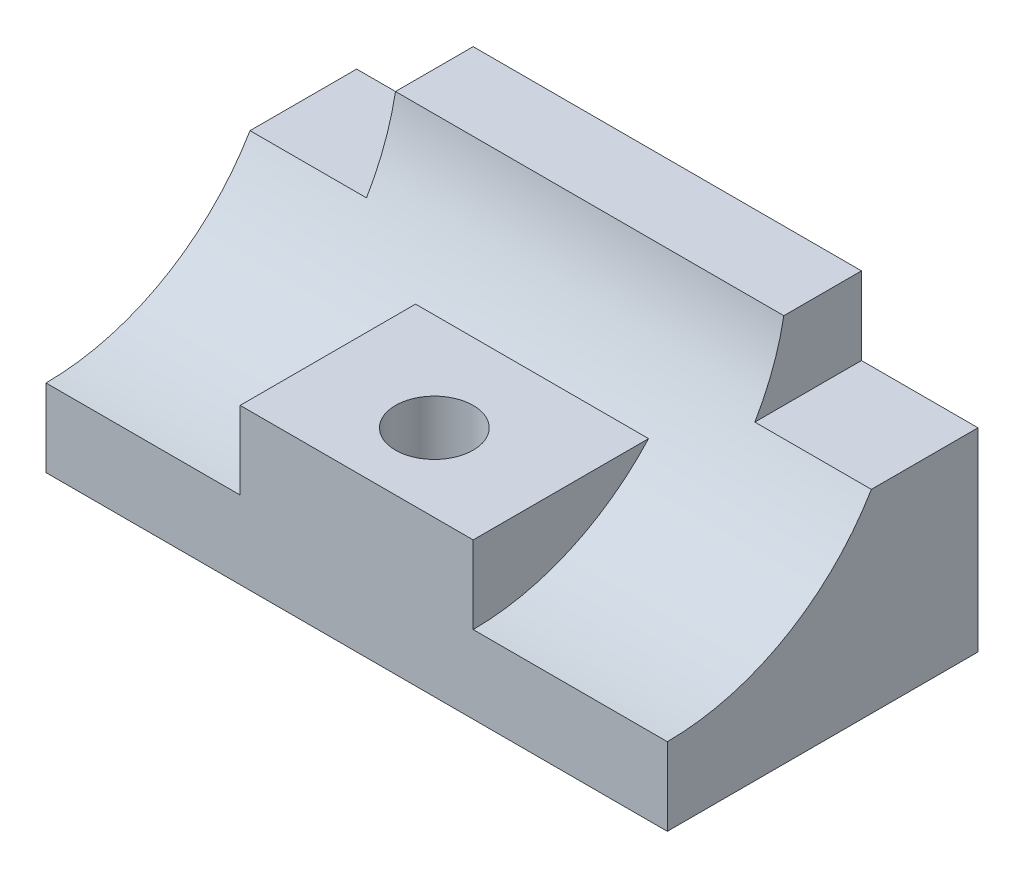
ISO-10303-21;
HEADER;
FILE_DESCRIPTION(('STEP AP214'),'2;1');
FILE_NAME('part.step','',(''),(''),'','','');
FILE_SCHEMA(('AUTOMOTIVE_DESIGN { 1 0 10303 214 1 1 1 1 }'));
ENDSEC;
DATA;
#1=APPLICATION_CONTEXT('core data for automotive mechanical design processes');
#2=APPLICATION_PROTOCOL_DEFINITION('international standard','automotive_design',2000,#1);
#3=PRODUCT_CONTEXT('',#1,'mechanical');
#4=PRODUCT('Part','Part','',(#3));
#5=PRODUCT_RELATED_PRODUCT_CATEGORY('part','',(#4));
#6=PRODUCT_DEFINITION_FORMATION('','',#4);
#7=PRODUCT_DEFINITION_CONTEXT('part definition',#1,'design');
#8=PRODUCT_DEFINITION('design','',#6,#7);
#9=PRODUCT_DEFINITION_SHAPE('','',#8);
#10=(LENGTH_UNIT() NAMED_UNIT(*) SI_UNIT(.MILLI.,.METRE.));
#11=(NAMED_UNIT(*) PLANE_ANGLE_UNIT() SI_UNIT($,.RADIAN.));
#12=(NAMED_UNIT(*) SI_UNIT($,.STERADIAN.) SOLID_ANGLE_UNIT());
#13=UNCERTAINTY_MEASURE_WITH_UNIT(LENGTH_MEASURE(1.E-05),#10,'distance_accuracy_value','');
#14=(GEOMETRIC_REPRESENTATION_CONTEXT(3) GLOBAL_UNCERTAINTY_ASSIGNED_CONTEXT((#13)) GLOBAL_UNIT_ASSIGNED_CONTEXT((#10,
#11,#12)) REPRESENTATION_CONTEXT('',''));
#15=CARTESIAN_POINT('',(0.,0.,0.));
#16=DIRECTION('',(0.,0.,1.));
#17=DIRECTION('',(1.,0.,0.));
#18=AXIS2_PLACEMENT_3D('',#15,#16,#17);
#19=CARTESIAN_POINT('',(80.,81.,80.));
#20=DIRECTION('',(-1.,0.,0.));
#21=DIRECTION('',(0.,0.,1.));
#22=AXIS2_PLACEMENT_3D('',#19,#20,#21);
#23=CYLINDRICAL_SURFACE('',#22,61.);
#24=CARTESIAN_POINT('',(-30.,81.,80.));
#25=DIRECTION('',(1.,0.,0.));
#26=DIRECTION('',(0.,0.,-1.));
#27=AXIS2_PLACEMENT_3D('',#24,#25,#26);
#28=CIRCLE('',#27,61.);
#29=CARTESIAN_POINT('',(-30.,40.,34.8336408374551));
#30=VERTEX_POINT('',#29);
#31=CARTESIAN_POINT('',(-30.,20.,80.));
#32=VERTEX_POINT('',#31);
#33=EDGE_CURVE('E162',#30,#32,#28,.F.);
#34=ORIENTED_EDGE('',*,*,#33,.F.);
#35=DIRECTION('',(-1.,0.,0.));
#36=VECTOR('',#35,1.);
#37=CARTESIAN_POINT('',(80.,40.,34.8336408374551));
#38=LINE('',#37,#36);
#39=CARTESIAN_POINT('',(30.,40.,34.8336408374551));
#40=VERTEX_POINT('',#39);
#41=EDGE_CURVE('E11',#40,#30,#38,.T.);
#42=ORIENTED_EDGE('',*,*,#41,.F.);
#43=CARTESIAN_POINT('',(30.,81.,80.));
#44=DIRECTION('',(-1.,0.,0.));
#45=DIRECTION('',(0.,0.,1.));
#46=AXIS2_PLACEMENT_3D('',#43,#44,#45);
#47=CIRCLE('',#46,61.);
#48=CARTESIAN_POINT('',(30.,20.,80.));
#49=VERTEX_POINT('',#48);
#50=EDGE_CURVE('E146',#49,#40,#47,.F.);
#51=ORIENTED_EDGE('',*,*,#50,.F.);
#52=DIRECTION('',(-1.,0.,0.));
#53=VECTOR('',#52,1.);
#54=CARTESIAN_POINT('',(80.,20.,80.));
#55=LINE('',#54,#53);
#56=CARTESIAN_POINT('',(80.,20.,80.));
#57=VERTEX_POINT('',#56);
#58=EDGE_CURVE('E138',#57,#49,#55,.T.);
#59=ORIENTED_EDGE('',*,*,#58,.F.);
#60=CARTESIAN_POINT('',(80.,81.,80.));
#61=DIRECTION('',(-1.,0.,0.));
#62=DIRECTION('',(0.,0.,1.));
#63=AXIS2_PLACEMENT_3D('',#60,#61,#62);
#64=CIRCLE('',#63,61.);
#65=CARTESIAN_POINT('',(80.,50.,27.4642978537452));
#66=VERTEX_POINT('',#65);
#67=EDGE_CURVE('E207',#66,#57,#64,.T.);
#68=ORIENTED_EDGE('',*,*,#67,.F.);
#69=DIRECTION('',(-1.,0.,0.));
#70=VECTOR('',#69,1.);
#71=CARTESIAN_POINT('',(80.,50.,27.4642978537452));
#72=LINE('',#71,#70);
#73=CARTESIAN_POINT('',(50.,50.,27.4642978537452));
#74=VERTEX_POINT('',#73);
#75=EDGE_CURVE('E66',#74,#66,#72,.F.);
#76=ORIENTED_EDGE('',*,*,#75,.F.);
#77=CARTESIAN_POINT('',(50.,81.,80.));
#78=DIRECTION('',(1.,0.,0.));
#79=DIRECTION('',(0.,0.,-1.));
#80=AXIS2_PLACEMENT_3D('',#77,#78,#79);
#81=CIRCLE('',#80,61.);
#82=CARTESIAN_POINT('',(50.,70.,20.));
#83=VERTEX_POINT('',#82);
#84=EDGE_CURVE('E251',#83,#74,#81,.F.);
#85=ORIENTED_EDGE('',*,*,#84,.F.);
#86=DIRECTION('',(-1.,0.,0.));
#87=VECTOR('',#86,1.);
#88=CARTESIAN_POINT('',(80.,70.,20.));
#89=LINE('',#88,#87);
#90=CARTESIAN_POINT('',(-50.,70.,20.));
#91=VERTEX_POINT('',#90);
#92=EDGE_CURVE('E233',#83,#91,#89,.T.);
#93=ORIENTED_EDGE('',*,*,#92,.T.);
#94=CARTESIAN_POINT('',(-50.,81.,80.));
#95=DIRECTION('',(-1.,0.,0.));
#96=DIRECTION('',(0.,0.,1.));
#97=AXIS2_PLACEMENT_3D('',#94,#95,#96);
#98=CIRCLE('',#97,61.);
#99=CARTESIAN_POINT('',(-50.,50.,27.4642978537452));
#100=VERTEX_POINT('',#99);
#101=EDGE_CURVE('E51',#100,#91,#98,.F.);
#102=ORIENTED_EDGE('',*,*,#101,.F.);
#103=DIRECTION('',(-1.,0.,0.));
#104=VECTOR('',#103,1.);
#105=CARTESIAN_POINT('',(80.,50.,27.4642978537452));
#106=LINE('',#105,#104);
#107=CARTESIAN_POINT('',(-80.,50.,27.4642978537452));
#108=VERTEX_POINT('',#107);
#109=EDGE_CURVE('E174',#108,#100,#106,.F.);
#110=ORIENTED_EDGE('',*,*,#109,.F.);
#111=CARTESIAN_POINT('',(-80.,81.,80.));
#112=DIRECTION('',(-1.,0.,0.));
#113=DIRECTION('',(0.,0.,1.));
#114=AXIS2_PLACEMENT_3D('',#111,#112,#113);
#115=CIRCLE('',#114,61.);
#116=CARTESIAN_POINT('',(-80.,20.,80.));
#117=VERTEX_POINT('',#116);
#118=EDGE_CURVE('E221',#108,#117,#115,.T.);
#119=ORIENTED_EDGE('',*,*,#118,.T.);
#120=EDGE_CURVE('E230',#32,#117,#55,.T.);
#121=ORIENTED_EDGE('',*,*,#120,.F.);
#122=EDGE_LOOP('',(#34,#42,#51,#59,#68,#76,#85,#93,#102,#110,#119,#121));
#123=FACE_BOUND('',#122,.T.);
#124=ADVANCED_FACE('F42',(#123),#23,.F.);
#125=CARTESIAN_POINT('',(80.,0.,0.));
#126=DIRECTION('',(0.,0.,1.));
#127=DIRECTION('',(1.,0.,0.));
#128=AXIS2_PLACEMENT_3D('',#125,#126,#127);
#129=PLANE('',#128);
#130=DIRECTION('',(-1.,0.,0.));
#131=VECTOR('',#130,1.);
#132=CARTESIAN_POINT('',(80.,0.,0.));
#133=LINE('',#132,#131);
#134=CARTESIAN_POINT('',(80.,0.,0.));
#135=VERTEX_POINT('',#134);
#136=CARTESIAN_POINT('',(-80.,0.,0.));
#137=VERTEX_POINT('',#136);
#138=EDGE_CURVE('E241',#135,#137,#133,.T.);
#139=ORIENTED_EDGE('',*,*,#138,.T.);
#140=DIRECTION('',(0.,1.,0.));
#141=VECTOR('',#140,1.);
#142=CARTESIAN_POINT('',(-80.,0.,0.));
#143=LINE('',#142,#141);
#144=CARTESIAN_POINT('',(-80.,50.,0.));
#145=VERTEX_POINT('',#144);
#146=EDGE_CURVE('E217',#137,#145,#143,.T.);
#147=ORIENTED_EDGE('',*,*,#146,.T.);
#148=DIRECTION('',(-1.,0.,0.));
#149=VECTOR('',#148,1.);
#150=CARTESIAN_POINT('',(80.,50.,0.));
#151=LINE('',#150,#149);
#152=CARTESIAN_POINT('',(-50.,50.,0.));
#153=VERTEX_POINT('',#152);
#154=EDGE_CURVE('E183',#153,#145,#151,.T.);
#155=ORIENTED_EDGE('',*,*,#154,.F.);
#156=DIRECTION('',(0.,-1.,0.));
#157=VECTOR('',#156,1.);
#158=CARTESIAN_POINT('',(-50.,0.,0.));
#159=LINE('',#158,#157);
#160=CARTESIAN_POINT('',(-50.,70.,0.));
#161=VERTEX_POINT('',#160);
#162=EDGE_CURVE('E194',#161,#153,#159,.T.);
#163=ORIENTED_EDGE('',*,*,#162,.F.);
#164=DIRECTION('',(-1.,0.,0.));
#165=VECTOR('',#164,1.);
#166=CARTESIAN_POINT('',(80.,70.,0.));
#167=LINE('',#166,#165);
#168=CARTESIAN_POINT('',(50.,70.,0.));
#169=VERTEX_POINT('',#168);
#170=EDGE_CURVE('E237',#169,#161,#167,.T.);
#171=ORIENTED_EDGE('',*,*,#170,.F.);
#172=DIRECTION('',(0.,1.,0.));
#173=VECTOR('',#172,1.);
#174=CARTESIAN_POINT('',(50.,0.,0.));
#175=LINE('',#174,#173);
#176=CARTESIAN_POINT('',(50.,50.,0.));
#177=VERTEX_POINT('',#176);
#178=EDGE_CURVE('E191',#177,#169,#175,.T.);
#179=ORIENTED_EDGE('',*,*,#178,.F.);
#180=DIRECTION('',(-1.,0.,0.));
#181=VECTOR('',#180,1.);
#182=CARTESIAN_POINT('',(80.,50.,0.));
#183=LINE('',#182,#181);
#184=CARTESIAN_POINT('',(80.,50.,0.));
#185=VERTEX_POINT('',#184);
#186=EDGE_CURVE('E188',#185,#177,#183,.T.);
#187=ORIENTED_EDGE('',*,*,#186,.F.);
#188=DIRECTION('',(0.,1.,0.));
#189=VECTOR('',#188,1.);
#190=CARTESIAN_POINT('',(80.,0.,0.));
#191=LINE('',#190,#189);
#192=EDGE_CURVE('E202',#135,#185,#191,.T.);
#193=ORIENTED_EDGE('',*,*,#192,.F.);
#194=EDGE_LOOP('',(#139,#147,#155,#163,#171,#179,#187,#193));
#195=FACE_BOUND('',#194,.T.);
#196=ADVANCED_FACE('F275',(#195),#129,.F.);
#197=CARTESIAN_POINT('',(80.,70.,0.));
#198=DIRECTION('',(0.,-1.,0.));
#199=DIRECTION('',(0.,0.,-1.));
#200=AXIS2_PLACEMENT_3D('',#197,#198,#199);
#201=PLANE('',#200);
#202=DIRECTION('',(0.,0.,-1.));
#203=VECTOR('',#202,1.);
#204=CARTESIAN_POINT('',(-50.,70.,80.));
#205=LINE('',#204,#203);
#206=EDGE_CURVE('E166',#91,#161,#205,.T.);
#207=ORIENTED_EDGE('',*,*,#206,.F.);
#208=ORIENTED_EDGE('',*,*,#92,.F.);
#209=DIRECTION('',(0.,0.,-1.));
#210=VECTOR('',#209,1.);
#211=CARTESIAN_POINT('',(50.,70.,80.));
#212=LINE('',#211,#210);
#213=EDGE_CURVE('E165',#83,#169,#212,.T.);
#214=ORIENTED_EDGE('',*,*,#213,.T.);
#215=ORIENTED_EDGE('',*,*,#170,.T.);
#216=EDGE_LOOP('',(#207,#208,#214,#215));
#217=FACE_BOUND('',#216,.T.);
#218=ADVANCED_FACE('F264',(#217),#201,.F.);
#219=CARTESIAN_POINT('',(80.,81.,80.));
#220=DIRECTION('',(-1.,0.,0.));
#221=DIRECTION('',(0.,0.,1.));
#222=AXIS2_PLACEMENT_3D('',#219,#220,#221);
#223=PLANE('',#222);
#224=DIRECTION('',(0.,0.,-1.));
#225=VECTOR('',#224,1.);
#226=CARTESIAN_POINT('',(80.,50.,80.));
#227=LINE('',#226,#225);
#228=EDGE_CURVE('E248',#66,#185,#227,.T.);
#229=ORIENTED_EDGE('',*,*,#228,.F.);
#230=ORIENTED_EDGE('',*,*,#67,.T.);
#231=DIRECTION('',(0.,-1.,0.));
#232=VECTOR('',#231,1.);
#233=CARTESIAN_POINT('',(80.,20.,80.));
#234=LINE('',#233,#232);
#235=CARTESIAN_POINT('',(80.,0.,80.));
#236=VERTEX_POINT('',#235);
#237=EDGE_CURVE('E210',#57,#236,#234,.T.);
#238=ORIENTED_EDGE('',*,*,#237,.T.);
#239=DIRECTION('',(0.,0.,-1.));
#240=VECTOR('',#239,1.);
#241=CARTESIAN_POINT('',(80.,0.,80.));
#242=LINE('',#241,#240);
#243=EDGE_CURVE('E198',#236,#135,#242,.T.);
#244=ORIENTED_EDGE('',*,*,#243,.T.);
#245=ORIENTED_EDGE('',*,*,#192,.T.);
#246=EDGE_LOOP('',(#229,#230,#238,#244,#245));
#247=FACE_BOUND('',#246,.T.);
#248=ADVANCED_FACE('F277',(#247),#223,.F.);
#249=CARTESIAN_POINT('',(-80.,81.,80.));
#250=DIRECTION('',(-1.,0.,0.));
#251=DIRECTION('',(0.,0.,1.));
#252=AXIS2_PLACEMENT_3D('',#249,#250,#251);
#253=PLANE('',#252);
#254=ORIENTED_EDGE('',*,*,#118,.F.);
#255=DIRECTION('',(0.,0.,-1.));
#256=VECTOR('',#255,1.);
#257=CARTESIAN_POINT('',(-80.,50.,80.));
#258=LINE('',#257,#256);
#259=EDGE_CURVE('E244',#108,#145,#258,.T.);
#260=ORIENTED_EDGE('',*,*,#259,.T.);
#261=ORIENTED_EDGE('',*,*,#146,.F.);
#262=DIRECTION('',(0.,0.,-1.));
#263=VECTOR('',#262,1.);
#264=CARTESIAN_POINT('',(-80.,0.,80.));
#265=LINE('',#264,#263);
#266=CARTESIAN_POINT('',(-80.,0.,80.));
#267=VERTEX_POINT('',#266);
#268=EDGE_CURVE('E197',#267,#137,#265,.T.);
#269=ORIENTED_EDGE('',*,*,#268,.F.);
#270=DIRECTION('',(0.,-1.,0.));
#271=VECTOR('',#270,1.);
#272=CARTESIAN_POINT('',(-80.,20.,80.));
#273=LINE('',#272,#271);
#274=EDGE_CURVE('E203',#117,#267,#273,.T.);
#275=ORIENTED_EDGE('',*,*,#274,.F.);
#276=EDGE_LOOP('',(#254,#260,#261,#269,#275));
#277=FACE_BOUND('',#276,.T.);
#278=ADVANCED_FACE('F287',(#277),#253,.T.);
#279=CARTESIAN_POINT('',(80.,0.,80.));
#280=DIRECTION('',(0.,1.,0.));
#281=DIRECTION('',(0.,0.,1.));
#282=AXIS2_PLACEMENT_3D('',#279,#280,#281);
#283=PLANE('',#282);
#284=CARTESIAN_POINT('',(0.,0.,60.));
#285=DIRECTION('',(0.,1.,0.));
#286=DIRECTION('',(0.,0.,1.));
#287=AXIS2_PLACEMENT_3D('',#284,#285,#286);
#288=CIRCLE('',#287,10.);
#289=CARTESIAN_POINT('',(0.,0.,70.));
#290=VERTEX_POINT('',#289);
#291=EDGE_CURVE('E299',#290,#290,#288,.T.);
#292=ORIENTED_EDGE('',*,*,#291,.T.);
#293=EDGE_LOOP('',(#292));
#294=FACE_BOUND('',#293,.T.);
#295=DIRECTION('',(-1.,0.,0.));
#296=VECTOR('',#295,1.);
#297=CARTESIAN_POINT('',(80.,0.,80.));
#298=LINE('',#297,#296);
#299=EDGE_CURVE('E213',#236,#267,#298,.T.);
#300=ORIENTED_EDGE('',*,*,#299,.T.);
#301=ORIENTED_EDGE('',*,*,#268,.T.);
#302=ORIENTED_EDGE('',*,*,#138,.F.);
#303=ORIENTED_EDGE('',*,*,#243,.F.);
#304=EDGE_LOOP('',(#300,#301,#302,#303));
#305=FACE_BOUND('',#304,.T.);
#306=ADVANCED_FACE('F44',(#294,#305),#283,.F.);
#307=CARTESIAN_POINT('',(80.,20.,80.));
#308=DIRECTION('',(0.,0.,-1.));
#309=DIRECTION('',(-1.,0.,0.));
#310=AXIS2_PLACEMENT_3D('',#307,#308,#309);
#311=PLANE('',#310);
#312=ORIENTED_EDGE('',*,*,#58,.T.);
#313=DIRECTION('',(0.,1.,0.));
#314=VECTOR('',#313,1.);
#315=CARTESIAN_POINT('',(30.,0.,80.));
#316=LINE('',#315,#314);
#317=CARTESIAN_POINT('',(30.,40.,80.));
#318=VERTEX_POINT('',#317);
#319=EDGE_CURVE('E130',#49,#318,#316,.T.);
#320=ORIENTED_EDGE('',*,*,#319,.T.);
#321=DIRECTION('',(-1.,0.,0.));
#322=VECTOR('',#321,1.);
#323=CARTESIAN_POINT('',(-30.,40.,80.));
#324=LINE('',#323,#322);
#325=CARTESIAN_POINT('',(-30.,40.,80.));
#326=VERTEX_POINT('',#325);
#327=EDGE_CURVE('E134',#318,#326,#324,.T.);
#328=ORIENTED_EDGE('',*,*,#327,.T.);
#329=DIRECTION('',(0.,-1.,0.));
#330=VECTOR('',#329,1.);
#331=CARTESIAN_POINT('',(-30.,0.,80.));
#332=LINE('',#331,#330);
#333=EDGE_CURVE('E58',#326,#32,#332,.T.);
#334=ORIENTED_EDGE('',*,*,#333,.T.);
#335=ORIENTED_EDGE('',*,*,#120,.T.);
#336=ORIENTED_EDGE('',*,*,#274,.T.);
#337=ORIENTED_EDGE('',*,*,#299,.F.);
#338=ORIENTED_EDGE('',*,*,#237,.F.);
#339=EDGE_LOOP('',(#312,#320,#328,#334,#335,#336,#337,#338));
#340=FACE_BOUND('',#339,.T.);
#341=ADVANCED_FACE('F132',(#340),#311,.F.);
#342=CARTESIAN_POINT('',(-50.,70.,80.));
#343=DIRECTION('',(-1.,0.,0.));
#344=DIRECTION('',(0.,0.,1.));
#345=AXIS2_PLACEMENT_3D('',#342,#343,#344);
#346=PLANE('',#345);
#347=ORIENTED_EDGE('',*,*,#162,.T.);
#348=DIRECTION('',(0.,0.,-1.));
#349=VECTOR('',#348,1.);
#350=CARTESIAN_POINT('',(-50.,50.,80.));
#351=LINE('',#350,#349);
#352=EDGE_CURVE('E169',#100,#153,#351,.T.);
#353=ORIENTED_EDGE('',*,*,#352,.F.);
#354=ORIENTED_EDGE('',*,*,#101,.T.);
#355=ORIENTED_EDGE('',*,*,#206,.T.);
#356=EDGE_LOOP('',(#347,#353,#354,#355));
#357=FACE_BOUND('',#356,.T.);
#358=ADVANCED_FACE('F258',(#357),#346,.T.);
#359=CARTESIAN_POINT('',(-80.,50.,80.));
#360=DIRECTION('',(0.,1.,0.));
#361=DIRECTION('',(0.,0.,1.));
#362=AXIS2_PLACEMENT_3D('',#359,#360,#361);
#363=PLANE('',#362);
#364=ORIENTED_EDGE('',*,*,#154,.T.);
#365=ORIENTED_EDGE('',*,*,#259,.F.);
#366=ORIENTED_EDGE('',*,*,#109,.T.);
#367=ORIENTED_EDGE('',*,*,#352,.T.);
#368=EDGE_LOOP('',(#364,#365,#366,#367));
#369=FACE_BOUND('',#368,.T.);
#370=ADVANCED_FACE('F290',(#369),#363,.T.);
#371=CARTESIAN_POINT('',(50.,70.,80.));
#372=DIRECTION('',(1.,0.,0.));
#373=DIRECTION('',(0.,0.,-1.));
#374=AXIS2_PLACEMENT_3D('',#371,#372,#373);
#375=PLANE('',#374);
#376=ORIENTED_EDGE('',*,*,#178,.T.);
#377=ORIENTED_EDGE('',*,*,#213,.F.);
#378=ORIENTED_EDGE('',*,*,#84,.T.);
#379=DIRECTION('',(0.,0.,-1.));
#380=VECTOR('',#379,1.);
#381=CARTESIAN_POINT('',(50.,50.,80.));
#382=LINE('',#381,#380);
#383=EDGE_CURVE('E170',#74,#177,#382,.T.);
#384=ORIENTED_EDGE('',*,*,#383,.T.);
#385=EDGE_LOOP('',(#376,#377,#378,#384));
#386=FACE_BOUND('',#385,.T.);
#387=ADVANCED_FACE('F270',(#386),#375,.T.);
#388=CARTESIAN_POINT('',(80.,50.,80.));
#389=DIRECTION('',(0.,1.,0.));
#390=DIRECTION('',(-1.,0.,0.));
#391=AXIS2_PLACEMENT_3D('',#388,#389,#390);
#392=PLANE('',#391);
#393=ORIENTED_EDGE('',*,*,#186,.T.);
#394=ORIENTED_EDGE('',*,*,#383,.F.);
#395=ORIENTED_EDGE('',*,*,#75,.T.);
#396=ORIENTED_EDGE('',*,*,#228,.T.);
#397=EDGE_LOOP('',(#393,#394,#395,#396));
#398=FACE_BOUND('',#397,.T.);
#399=ADVANCED_FACE('F272',(#398),#392,.T.);
#400=CARTESIAN_POINT('',(-30.,40.,80.));
#401=DIRECTION('',(0.,-1.,0.));
#402=DIRECTION('',(0.,0.,-1.));
#403=AXIS2_PLACEMENT_3D('',#400,#401,#402);
#404=PLANE('',#403);
#405=CARTESIAN_POINT('',(0.,40.,60.));
#406=DIRECTION('',(0.,1.,0.));
#407=DIRECTION('',(0.,0.,1.));
#408=AXIS2_PLACEMENT_3D('',#405,#406,#407);
#409=CIRCLE('',#408,10.);
#410=CARTESIAN_POINT('',(0.,40.,70.));
#411=VERTEX_POINT('',#410);
#412=EDGE_CURVE('E296',#411,#411,#409,.T.);
#413=ORIENTED_EDGE('',*,*,#412,.F.);
#414=EDGE_LOOP('',(#413));
#415=FACE_BOUND('',#414,.T.);
#416=DIRECTION('',(0.,0.,-1.));
#417=VECTOR('',#416,1.);
#418=CARTESIAN_POINT('',(30.,40.,80.));
#419=LINE('',#418,#417);
#420=EDGE_CURVE('E144',#318,#40,#419,.T.);
#421=ORIENTED_EDGE('',*,*,#420,.T.);
#422=ORIENTED_EDGE('',*,*,#41,.T.);
#423=DIRECTION('',(0.,0.,-1.));
#424=VECTOR('',#423,1.);
#425=CARTESIAN_POINT('',(-30.,40.,80.));
#426=LINE('',#425,#424);
#427=EDGE_CURVE('E150',#326,#30,#426,.T.);
#428=ORIENTED_EDGE('',*,*,#427,.F.);
#429=ORIENTED_EDGE('',*,*,#327,.F.);
#430=EDGE_LOOP('',(#421,#422,#428,#429));
#431=FACE_BOUND('',#430,.T.);
#432=ADVANCED_FACE('F152',(#415,#431),#404,.F.);
#433=CARTESIAN_POINT('',(-30.,0.,80.));
#434=DIRECTION('',(1.,0.,0.));
#435=DIRECTION('',(0.,0.,-1.));
#436=AXIS2_PLACEMENT_3D('',#433,#434,#435);
#437=PLANE('',#436);
#438=ORIENTED_EDGE('',*,*,#427,.T.);
#439=ORIENTED_EDGE('',*,*,#33,.T.);
#440=ORIENTED_EDGE('',*,*,#333,.F.);
#441=EDGE_LOOP('',(#438,#439,#440));
#442=FACE_BOUND('',#441,.T.);
#443=ADVANCED_FACE('F294',(#442),#437,.F.);
#444=CARTESIAN_POINT('',(30.,0.,80.));
#445=DIRECTION('',(-1.,0.,0.));
#446=DIRECTION('',(0.,0.,1.));
#447=AXIS2_PLACEMENT_3D('',#444,#445,#446);
#448=PLANE('',#447);
#449=ORIENTED_EDGE('',*,*,#319,.F.);
#450=ORIENTED_EDGE('',*,*,#50,.T.);
#451=ORIENTED_EDGE('',*,*,#420,.F.);
#452=EDGE_LOOP('',(#449,#450,#451));
#453=FACE_BOUND('',#452,.T.);
#454=ADVANCED_FACE('F145',(#453),#448,.F.);
#455=CARTESIAN_POINT('',(0.,40.,60.));
#456=DIRECTION('',(0.,-1.,0.));
#457=DIRECTION('',(0.,0.,-1.));
#458=AXIS2_PLACEMENT_3D('',#455,#456,#457);
#459=CYLINDRICAL_SURFACE('',#458,10.);
#460=ORIENTED_EDGE('',*,*,#412,.T.);
#461=EDGE_LOOP('',(#460));
#462=FACE_BOUND('',#461,.T.);
#463=ORIENTED_EDGE('',*,*,#291,.F.);
#464=EDGE_LOOP('',(#463));
#465=FACE_BOUND('',#464,.T.);
#466=ADVANCED_FACE('F307',(#462,#465),#459,.F.);
#467=CLOSED_SHELL('',(#124,#196,#218,#248,#278,#306,#341,#358,#370,#387,#399,#432,#443,#454,#466));
#468=MANIFOLD_SOLID_BREP('B2',#467);
#469=ADVANCED_BREP_SHAPE_REPRESENTATION('',(#18,#468),#14);
#470=SHAPE_DEFINITION_REPRESENTATION(#9,#469);
ENDSEC;
END-ISO-10303-21;
